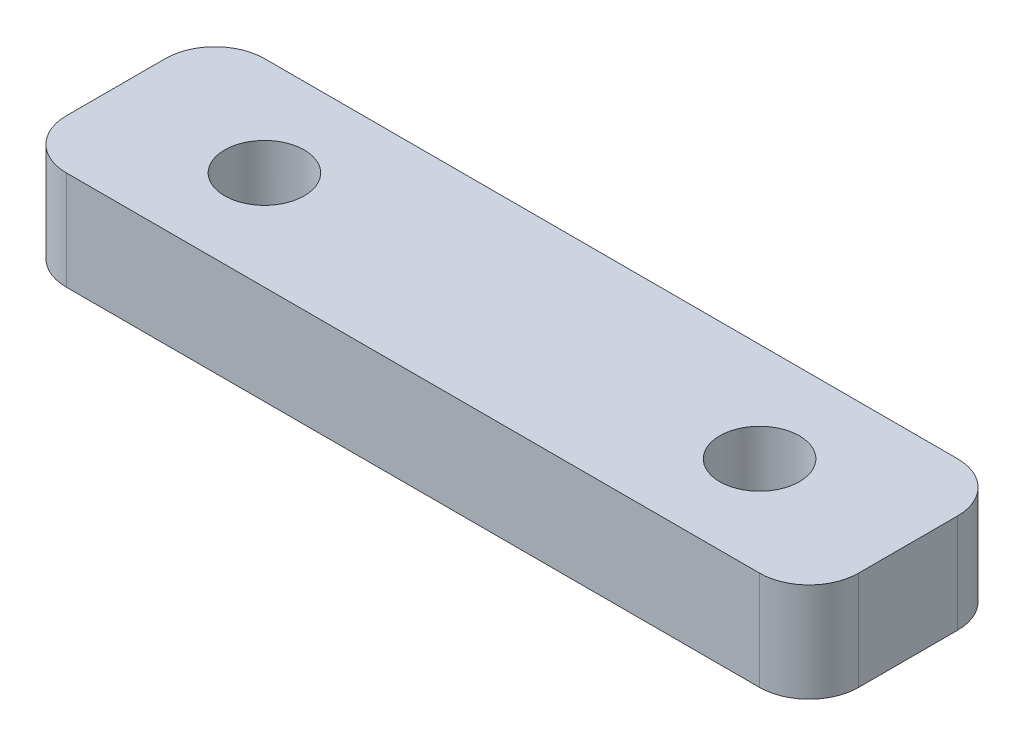
ISO-10303-21;
HEADER;
FILE_DESCRIPTION(('STEP AP214'),'2;1');
FILE_NAME('part.step','',(''),(''),'','','');
FILE_SCHEMA(('AUTOMOTIVE_DESIGN { 1 0 10303 214 1 1 1 1 }'));
ENDSEC;
DATA;
#1=APPLICATION_CONTEXT('core data for automotive mechanical design processes');
#2=APPLICATION_PROTOCOL_DEFINITION('international standard','automotive_design',2000,#1);
#3=PRODUCT_CONTEXT('',#1,'mechanical');
#4=PRODUCT('Part','Part','',(#3));
#5=PRODUCT_RELATED_PRODUCT_CATEGORY('part','',(#4));
#6=PRODUCT_DEFINITION_FORMATION('','',#4);
#7=PRODUCT_DEFINITION_CONTEXT('part definition',#1,'design');
#8=PRODUCT_DEFINITION('design','',#6,#7);
#9=PRODUCT_DEFINITION_SHAPE('','',#8);
#10=(LENGTH_UNIT() NAMED_UNIT(*) SI_UNIT(.MILLI.,.METRE.));
#11=(NAMED_UNIT(*) PLANE_ANGLE_UNIT() SI_UNIT($,.RADIAN.));
#12=(NAMED_UNIT(*) SI_UNIT($,.STERADIAN.) SOLID_ANGLE_UNIT());
#13=UNCERTAINTY_MEASURE_WITH_UNIT(LENGTH_MEASURE(1.E-05),#10,'distance_accuracy_value','');
#14=(GEOMETRIC_REPRESENTATION_CONTEXT(3) GLOBAL_UNCERTAINTY_ASSIGNED_CONTEXT((#13)) GLOBAL_UNIT_ASSIGNED_CONTEXT((#10,
#11,#12)) REPRESENTATION_CONTEXT('',''));
#15=CARTESIAN_POINT('',(0.,0.,0.));
#16=DIRECTION('',(0.,0.,1.));
#17=DIRECTION('',(1.,0.,0.));
#18=AXIS2_PLACEMENT_3D('',#15,#16,#17);
#19=CARTESIAN_POINT('',(0.,6.35,0.));
#20=DIRECTION('',(1.,0.,0.));
#21=DIRECTION('',(0.,0.,-1.));
#22=AXIS2_PLACEMENT_3D('',#19,#20,#21);
#23=PLANE('',#22);
#24=DIRECTION('',(0.,0.,1.));
#25=VECTOR('',#24,1.);
#26=CARTESIAN_POINT('',(0.,6.35,0.));
#27=LINE('',#26,#25);
#28=CARTESIAN_POINT('',(0.,6.35,3.175));
#29=VERTEX_POINT('',#28);
#30=CARTESIAN_POINT('',(0.,6.35,9.525));
#31=VERTEX_POINT('',#30);
#32=EDGE_CURVE('E138',#29,#31,#27,.T.);
#33=ORIENTED_EDGE('',*,*,#32,.F.);
#34=DIRECTION('',(0.,-1.,0.));
#35=VECTOR('',#34,1.);
#36=CARTESIAN_POINT('',(0.,0.,3.175));
#37=LINE('',#36,#35);
#38=CARTESIAN_POINT('',(0.,0.,3.175));
#39=VERTEX_POINT('',#38);
#40=EDGE_CURVE('E11',#29,#39,#37,.T.);
#41=ORIENTED_EDGE('',*,*,#40,.T.);
#42=DIRECTION('',(0.,0.,1.));
#43=VECTOR('',#42,1.);
#44=CARTESIAN_POINT('',(0.,0.,0.));
#45=LINE('',#44,#43);
#46=CARTESIAN_POINT('',(0.,0.,9.525));
#47=VERTEX_POINT('',#46);
#48=EDGE_CURVE('E122',#39,#47,#45,.T.);
#49=ORIENTED_EDGE('',*,*,#48,.T.);
#50=DIRECTION('',(0.,-1.,0.));
#51=VECTOR('',#50,1.);
#52=CARTESIAN_POINT('',(0.,6.35,9.525));
#53=LINE('',#52,#51);
#54=EDGE_CURVE('E48',#47,#31,#53,.F.);
#55=ORIENTED_EDGE('',*,*,#54,.T.);
#56=EDGE_LOOP('',(#33,#41,#49,#55));
#57=FACE_BOUND('',#56,.T.);
#58=ADVANCED_FACE('F40',(#57),#23,.F.);
#59=CARTESIAN_POINT('',(0.,6.35,12.7));
#60=DIRECTION('',(0.,0.,-1.));
#61=DIRECTION('',(-1.,0.,0.));
#62=AXIS2_PLACEMENT_3D('',#59,#60,#61);
#63=PLANE('',#62);
#64=DIRECTION('',(1.,0.,0.));
#65=VECTOR('',#64,1.);
#66=CARTESIAN_POINT('',(0.,0.,12.7));
#67=LINE('',#66,#65);
#68=CARTESIAN_POINT('',(3.17500000000001,0.,12.7));
#69=VERTEX_POINT('',#68);
#70=CARTESIAN_POINT('',(47.625,0.,12.7));
#71=VERTEX_POINT('',#70);
#72=EDGE_CURVE('E192',#69,#71,#67,.T.);
#73=ORIENTED_EDGE('',*,*,#72,.T.);
#74=DIRECTION('',(0.,-1.,0.));
#75=VECTOR('',#74,1.);
#76=CARTESIAN_POINT('',(47.625,6.35,12.7));
#77=LINE('',#76,#75);
#78=CARTESIAN_POINT('',(47.625,6.35,12.7));
#79=VERTEX_POINT('',#78);
#80=EDGE_CURVE('E58',#71,#79,#77,.F.);
#81=ORIENTED_EDGE('',*,*,#80,.T.);
#82=DIRECTION('',(1.,0.,0.));
#83=VECTOR('',#82,1.);
#84=CARTESIAN_POINT('',(0.,6.35,12.7));
#85=LINE('',#84,#83);
#86=CARTESIAN_POINT('',(3.17500000000001,6.35,12.7));
#87=VERTEX_POINT('',#86);
#88=EDGE_CURVE('E187',#87,#79,#85,.T.);
#89=ORIENTED_EDGE('',*,*,#88,.F.);
#90=DIRECTION('',(0.,-1.,0.));
#91=VECTOR('',#90,1.);
#92=CARTESIAN_POINT('',(3.17500000000001,6.35,12.7));
#93=LINE('',#92,#91);
#94=EDGE_CURVE('E176',#87,#69,#93,.T.);
#95=ORIENTED_EDGE('',*,*,#94,.T.);
#96=EDGE_LOOP('',(#73,#81,#89,#95));
#97=FACE_BOUND('',#96,.T.);
#98=ADVANCED_FACE('F191',(#97),#63,.F.);
#99=CARTESIAN_POINT('',(50.8,6.35,0.));
#100=DIRECTION('',(1.,0.,0.));
#101=DIRECTION('',(0.,0.,-1.));
#102=AXIS2_PLACEMENT_3D('',#99,#100,#101);
#103=PLANE('',#102);
#104=DIRECTION('',(0.,0.,1.));
#105=VECTOR('',#104,1.);
#106=CARTESIAN_POINT('',(50.8,0.,0.));
#107=LINE('',#106,#105);
#108=CARTESIAN_POINT('',(50.8,0.,3.175));
#109=VERTEX_POINT('',#108);
#110=CARTESIAN_POINT('',(50.8,0.,9.525));
#111=VERTEX_POINT('',#110);
#112=EDGE_CURVE('E139',#109,#111,#107,.T.);
#113=ORIENTED_EDGE('',*,*,#112,.F.);
#114=DIRECTION('',(0.,-1.,0.));
#115=VECTOR('',#114,1.);
#116=CARTESIAN_POINT('',(50.8,6.35,3.175));
#117=LINE('',#116,#115);
#118=CARTESIAN_POINT('',(50.8,6.35,3.175));
#119=VERTEX_POINT('',#118);
#120=EDGE_CURVE('E164',#109,#119,#117,.F.);
#121=ORIENTED_EDGE('',*,*,#120,.T.);
#122=DIRECTION('',(0.,0.,1.));
#123=VECTOR('',#122,1.);
#124=CARTESIAN_POINT('',(50.8,6.35,0.));
#125=LINE('',#124,#123);
#126=CARTESIAN_POINT('',(50.8,6.35,9.525));
#127=VERTEX_POINT('',#126);
#128=EDGE_CURVE('E149',#119,#127,#125,.T.);
#129=ORIENTED_EDGE('',*,*,#128,.T.);
#130=DIRECTION('',(0.,-1.,0.));
#131=VECTOR('',#130,1.);
#132=CARTESIAN_POINT('',(50.8,0.,9.525));
#133=LINE('',#132,#131);
#134=EDGE_CURVE('E160',#127,#111,#133,.T.);
#135=ORIENTED_EDGE('',*,*,#134,.T.);
#136=EDGE_LOOP('',(#113,#121,#129,#135));
#137=FACE_BOUND('',#136,.T.);
#138=ADVANCED_FACE('F241',(#137),#103,.T.);
#139=CARTESIAN_POINT('',(0.,6.35,0.));
#140=DIRECTION('',(0.,0.,-1.));
#141=DIRECTION('',(-1.,0.,0.));
#142=AXIS2_PLACEMENT_3D('',#139,#140,#141);
#143=PLANE('',#142);
#144=DIRECTION('',(1.,0.,0.));
#145=VECTOR('',#144,1.);
#146=CARTESIAN_POINT('',(0.,6.35,0.));
#147=LINE('',#146,#145);
#148=CARTESIAN_POINT('',(3.175,6.35,0.));
#149=VERTEX_POINT('',#148);
#150=CARTESIAN_POINT('',(47.625,6.35,0.));
#151=VERTEX_POINT('',#150);
#152=EDGE_CURVE('E144',#149,#151,#147,.T.);
#153=ORIENTED_EDGE('',*,*,#152,.T.);
#154=DIRECTION('',(0.,-1.,0.));
#155=VECTOR('',#154,1.);
#156=CARTESIAN_POINT('',(47.625,6.35,0.));
#157=LINE('',#156,#155);
#158=CARTESIAN_POINT('',(47.625,0.,0.));
#159=VERTEX_POINT('',#158);
#160=EDGE_CURVE('E136',#151,#159,#157,.T.);
#161=ORIENTED_EDGE('',*,*,#160,.T.);
#162=DIRECTION('',(1.,0.,0.));
#163=VECTOR('',#162,1.);
#164=CARTESIAN_POINT('',(0.,0.,0.));
#165=LINE('',#164,#163);
#166=CARTESIAN_POINT('',(3.175,0.,0.));
#167=VERTEX_POINT('',#166);
#168=EDGE_CURVE('E120',#167,#159,#165,.T.);
#169=ORIENTED_EDGE('',*,*,#168,.F.);
#170=DIRECTION('',(0.,-1.,0.));
#171=VECTOR('',#170,1.);
#172=CARTESIAN_POINT('',(3.175,6.35,0.));
#173=LINE('',#172,#171);
#174=EDGE_CURVE('E133',#167,#149,#173,.F.);
#175=ORIENTED_EDGE('',*,*,#174,.T.);
#176=EDGE_LOOP('',(#153,#161,#169,#175));
#177=FACE_BOUND('',#176,.T.);
#178=ADVANCED_FACE('F132',(#177),#143,.T.);
#179=CARTESIAN_POINT('',(0.,6.35,0.));
#180=DIRECTION('',(0.,1.,0.));
#181=DIRECTION('',(0.,0.,1.));
#182=AXIS2_PLACEMENT_3D('',#179,#180,#181);
#183=PLANE('',#182);
#184=CARTESIAN_POINT('',(9.525,6.35,6.35));
#185=DIRECTION('',(0.,1.,0.));
#186=DIRECTION('',(0.,0.,1.));
#187=AXIS2_PLACEMENT_3D('',#184,#185,#186);
#188=CIRCLE('',#187,2.5527);
#189=CARTESIAN_POINT('',(9.525,6.35,8.9027));
#190=VERTEX_POINT('',#189);
#191=EDGE_CURVE('E212',#190,#190,#188,.T.);
#192=ORIENTED_EDGE('',*,*,#191,.F.);
#193=EDGE_LOOP('',(#192));
#194=FACE_BOUND('',#193,.T.);
#195=CARTESIAN_POINT('',(41.275,6.35,6.35));
#196=DIRECTION('',(0.,1.,0.));
#197=DIRECTION('',(0.,0.,1.));
#198=AXIS2_PLACEMENT_3D('',#195,#196,#197);
#199=CIRCLE('',#198,2.5527);
#200=CARTESIAN_POINT('',(41.275,6.35,8.9027));
#201=VERTEX_POINT('',#200);
#202=EDGE_CURVE('E198',#201,#201,#199,.T.);
#203=ORIENTED_EDGE('',*,*,#202,.F.);
#204=EDGE_LOOP('',(#203));
#205=FACE_BOUND('',#204,.T.);
#206=ORIENTED_EDGE('',*,*,#128,.F.);
#207=CARTESIAN_POINT('',(47.625,6.35,3.175));
#208=DIRECTION('',(0.,1.,0.));
#209=DIRECTION('',(0.,0.,1.));
#210=AXIS2_PLACEMENT_3D('',#207,#208,#209);
#211=CIRCLE('',#210,3.175);
#212=EDGE_CURVE('E173',#119,#151,#211,.T.);
#213=ORIENTED_EDGE('',*,*,#212,.T.);
#214=ORIENTED_EDGE('',*,*,#152,.F.);
#215=CARTESIAN_POINT('',(3.175,6.35,3.175));
#216=DIRECTION('',(0.,1.,0.));
#217=DIRECTION('',(0.,0.,1.));
#218=AXIS2_PLACEMENT_3D('',#215,#216,#217);
#219=CIRCLE('',#218,3.175);
#220=EDGE_CURVE('E143',#149,#29,#219,.T.);
#221=ORIENTED_EDGE('',*,*,#220,.T.);
#222=ORIENTED_EDGE('',*,*,#32,.T.);
#223=CARTESIAN_POINT('',(3.17500000000001,6.35,9.525));
#224=DIRECTION('',(0.,1.,0.));
#225=DIRECTION('',(0.,0.,1.));
#226=AXIS2_PLACEMENT_3D('',#223,#224,#225);
#227=CIRCLE('',#226,3.175);
#228=EDGE_CURVE('E67',#31,#87,#227,.T.);
#229=ORIENTED_EDGE('',*,*,#228,.T.);
#230=ORIENTED_EDGE('',*,*,#88,.T.);
#231=CARTESIAN_POINT('',(47.625,6.35,9.525));
#232=DIRECTION('',(0.,1.,0.));
#233=DIRECTION('',(0.,0.,1.));
#234=AXIS2_PLACEMENT_3D('',#231,#232,#233);
#235=CIRCLE('',#234,3.175);
#236=EDGE_CURVE('E170',#79,#127,#235,.T.);
#237=ORIENTED_EDGE('',*,*,#236,.T.);
#238=EDGE_LOOP('',(#206,#213,#214,#221,#222,#229,#230,#237));
#239=FACE_BOUND('',#238,.T.);
#240=ADVANCED_FACE('F186',(#194,#205,#239),#183,.T.);
#241=CARTESIAN_POINT('',(0.,0.,0.));
#242=DIRECTION('',(0.,1.,0.));
#243=DIRECTION('',(0.,0.,1.));
#244=AXIS2_PLACEMENT_3D('',#241,#242,#243);
#245=PLANE('',#244);
#246=CARTESIAN_POINT('',(9.525,0.,6.35));
#247=DIRECTION('',(0.,-1.,0.));
#248=DIRECTION('',(0.,0.,-1.));
#249=AXIS2_PLACEMENT_3D('',#246,#247,#248);
#250=CIRCLE('',#249,2.5527);
#251=CARTESIAN_POINT('',(9.525,0.,3.7973));
#252=VERTEX_POINT('',#251);
#253=EDGE_CURVE('E216',#252,#252,#250,.T.);
#254=ORIENTED_EDGE('',*,*,#253,.F.);
#255=EDGE_LOOP('',(#254));
#256=FACE_BOUND('',#255,.T.);
#257=CARTESIAN_POINT('',(41.275,0.,6.35));
#258=DIRECTION('',(0.,-1.,0.));
#259=DIRECTION('',(0.,0.,-1.));
#260=AXIS2_PLACEMENT_3D('',#257,#258,#259);
#261=CIRCLE('',#260,2.5527);
#262=CARTESIAN_POINT('',(41.275,0.,3.7973));
#263=VERTEX_POINT('',#262);
#264=EDGE_CURVE('E208',#263,#263,#261,.T.);
#265=ORIENTED_EDGE('',*,*,#264,.F.);
#266=EDGE_LOOP('',(#265));
#267=FACE_BOUND('',#266,.T.);
#268=ORIENTED_EDGE('',*,*,#168,.T.);
#269=CARTESIAN_POINT('',(47.625,0.,3.175));
#270=DIRECTION('',(0.,1.,0.));
#271=DIRECTION('',(0.,0.,1.));
#272=AXIS2_PLACEMENT_3D('',#269,#270,#271);
#273=CIRCLE('',#272,3.175);
#274=EDGE_CURVE('E157',#159,#109,#273,.F.);
#275=ORIENTED_EDGE('',*,*,#274,.T.);
#276=ORIENTED_EDGE('',*,*,#112,.T.);
#277=CARTESIAN_POINT('',(47.625,0.,9.525));
#278=DIRECTION('',(0.,1.,0.));
#279=DIRECTION('',(0.,0.,1.));
#280=AXIS2_PLACEMENT_3D('',#277,#278,#279);
#281=CIRCLE('',#280,3.175);
#282=EDGE_CURVE('E126',#111,#71,#281,.F.);
#283=ORIENTED_EDGE('',*,*,#282,.T.);
#284=ORIENTED_EDGE('',*,*,#72,.F.);
#285=CARTESIAN_POINT('',(3.17500000000001,0.,9.525));
#286=DIRECTION('',(0.,1.,0.));
#287=DIRECTION('',(0.,0.,1.));
#288=AXIS2_PLACEMENT_3D('',#285,#286,#287);
#289=CIRCLE('',#288,3.175);
#290=EDGE_CURVE('E127',#69,#47,#289,.F.);
#291=ORIENTED_EDGE('',*,*,#290,.T.);
#292=ORIENTED_EDGE('',*,*,#48,.F.);
#293=CARTESIAN_POINT('',(3.175,0.,3.175));
#294=DIRECTION('',(0.,1.,0.));
#295=DIRECTION('',(0.,0.,1.));
#296=AXIS2_PLACEMENT_3D('',#293,#294,#295);
#297=CIRCLE('',#296,3.175);
#298=EDGE_CURVE('E117',#39,#167,#297,.F.);
#299=ORIENTED_EDGE('',*,*,#298,.T.);
#300=EDGE_LOOP('',(#268,#275,#276,#283,#284,#291,#292,#299));
#301=FACE_BOUND('',#300,.T.);
#302=ADVANCED_FACE('F119',(#256,#267,#301),#245,.F.);
#303=CARTESIAN_POINT('',(41.275,0.,6.35));
#304=DIRECTION('',(0.,-1.,0.));
#305=DIRECTION('',(0.,0.,-1.));
#306=AXIS2_PLACEMENT_3D('',#303,#304,#305);
#307=CYLINDRICAL_SURFACE('',#306,2.5527);
#308=ORIENTED_EDGE('',*,*,#264,.T.);
#309=EDGE_LOOP('',(#308));
#310=FACE_BOUND('',#309,.T.);
#311=ORIENTED_EDGE('',*,*,#202,.T.);
#312=EDGE_LOOP('',(#311));
#313=FACE_BOUND('',#312,.T.);
#314=ADVANCED_FACE('F226',(#310,#313),#307,.F.);
#315=CARTESIAN_POINT('',(9.525,0.,6.35));
#316=DIRECTION('',(0.,-1.,0.));
#317=DIRECTION('',(0.,0.,-1.));
#318=AXIS2_PLACEMENT_3D('',#315,#316,#317);
#319=CYLINDRICAL_SURFACE('',#318,2.5527);
#320=ORIENTED_EDGE('',*,*,#253,.T.);
#321=EDGE_LOOP('',(#320));
#322=FACE_BOUND('',#321,.T.);
#323=ORIENTED_EDGE('',*,*,#191,.T.);
#324=EDGE_LOOP('',(#323));
#325=FACE_BOUND('',#324,.T.);
#326=ADVANCED_FACE('F221',(#322,#325),#319,.F.);
#327=CARTESIAN_POINT('',(47.625,6.35,3.175));
#328=DIRECTION('',(0.,-1.,0.));
#329=DIRECTION('',(0.,0.,-1.));
#330=AXIS2_PLACEMENT_3D('',#327,#328,#329);
#331=CYLINDRICAL_SURFACE('',#330,3.175);
#332=ORIENTED_EDGE('',*,*,#212,.F.);
#333=ORIENTED_EDGE('',*,*,#120,.F.);
#334=ORIENTED_EDGE('',*,*,#274,.F.);
#335=ORIENTED_EDGE('',*,*,#160,.F.);
#336=EDGE_LOOP('',(#332,#333,#334,#335));
#337=FACE_BOUND('',#336,.T.);
#338=ADVANCED_FACE('F252',(#337),#331,.T.);
#339=CARTESIAN_POINT('',(47.625,6.35,9.525));
#340=DIRECTION('',(0.,1.,0.));
#341=DIRECTION('',(0.,0.,1.));
#342=AXIS2_PLACEMENT_3D('',#339,#340,#341);
#343=CYLINDRICAL_SURFACE('',#342,3.175);
#344=ORIENTED_EDGE('',*,*,#236,.F.);
#345=ORIENTED_EDGE('',*,*,#80,.F.);
#346=ORIENTED_EDGE('',*,*,#282,.F.);
#347=ORIENTED_EDGE('',*,*,#134,.F.);
#348=EDGE_LOOP('',(#344,#345,#346,#347));
#349=FACE_BOUND('',#348,.T.);
#350=ADVANCED_FACE('F255',(#349),#343,.T.);
#351=CARTESIAN_POINT('',(3.175,6.35,3.175));
#352=DIRECTION('',(0.,1.,0.));
#353=DIRECTION('',(0.,0.,1.));
#354=AXIS2_PLACEMENT_3D('',#351,#352,#353);
#355=CYLINDRICAL_SURFACE('',#354,3.175);
#356=ORIENTED_EDGE('',*,*,#220,.F.);
#357=ORIENTED_EDGE('',*,*,#174,.F.);
#358=ORIENTED_EDGE('',*,*,#298,.F.);
#359=ORIENTED_EDGE('',*,*,#40,.F.);
#360=EDGE_LOOP('',(#356,#357,#358,#359));
#361=FACE_BOUND('',#360,.T.);
#362=ADVANCED_FACE('F142',(#361),#355,.T.);
#363=CARTESIAN_POINT('',(3.17500000000001,6.35,9.525));
#364=DIRECTION('',(0.,-1.,0.));
#365=DIRECTION('',(0.,0.,-1.));
#366=AXIS2_PLACEMENT_3D('',#363,#364,#365);
#367=CYLINDRICAL_SURFACE('',#366,3.175);
#368=ORIENTED_EDGE('',*,*,#228,.F.);
#369=ORIENTED_EDGE('',*,*,#54,.F.);
#370=ORIENTED_EDGE('',*,*,#290,.F.);
#371=ORIENTED_EDGE('',*,*,#94,.F.);
#372=EDGE_LOOP('',(#368,#369,#370,#371));
#373=FACE_BOUND('',#372,.T.);
#374=ADVANCED_FACE('F42',(#373),#367,.T.);
#375=CLOSED_SHELL('',(#58,#98,#138,#178,#240,#302,#314,#326,#338,#350,#362,#374));
#376=MANIFOLD_SOLID_BREP('B2',#375);
#377=ADVANCED_BREP_SHAPE_REPRESENTATION('',(#18,#376),#14);
#378=SHAPE_DEFINITION_REPRESENTATION(#9,#377);
ENDSEC;
END-ISO-10303-21;
